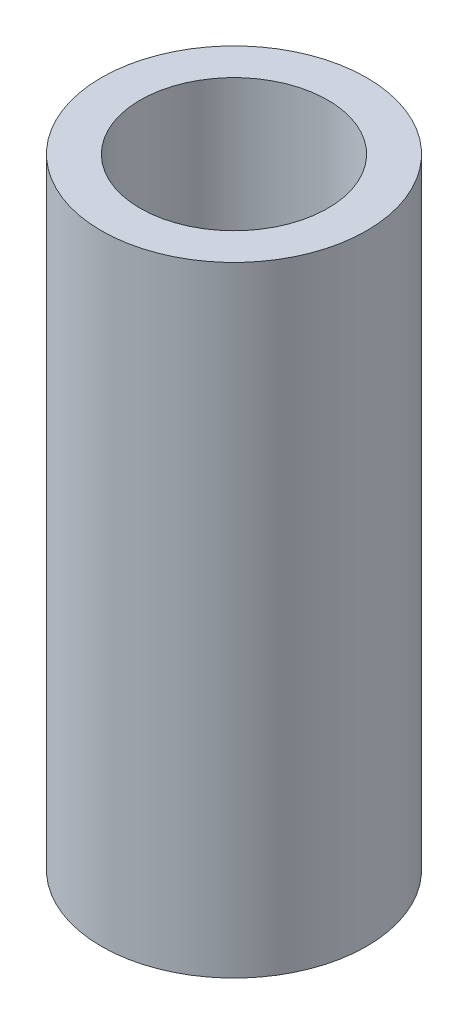
ISO-10303-21;
HEADER;
FILE_DESCRIPTION(('STEP AP214'),'2;1');
FILE_NAME('part.step','',(''),(''),'','','');
FILE_SCHEMA(('AUTOMOTIVE_DESIGN { 1 0 10303 214 1 1 1 1 }'));
ENDSEC;
DATA;
#1=APPLICATION_CONTEXT('core data for automotive mechanical design processes');
#2=APPLICATION_PROTOCOL_DEFINITION('international standard','automotive_design',2000,#1);
#3=PRODUCT_CONTEXT('',#1,'mechanical');
#4=PRODUCT('Part','Part','',(#3));
#5=PRODUCT_RELATED_PRODUCT_CATEGORY('part','',(#4));
#6=PRODUCT_DEFINITION_FORMATION('','',#4);
#7=PRODUCT_DEFINITION_CONTEXT('part definition',#1,'design');
#8=PRODUCT_DEFINITION('design','',#6,#7);
#9=PRODUCT_DEFINITION_SHAPE('','',#8);
#10=(LENGTH_UNIT() NAMED_UNIT(*) SI_UNIT(.MILLI.,.METRE.));
#11=(NAMED_UNIT(*) PLANE_ANGLE_UNIT() SI_UNIT($,.RADIAN.));
#12=(NAMED_UNIT(*) SI_UNIT($,.STERADIAN.) SOLID_ANGLE_UNIT());
#13=UNCERTAINTY_MEASURE_WITH_UNIT(LENGTH_MEASURE(1.E-05),#10,'distance_accuracy_value','');
#14=(GEOMETRIC_REPRESENTATION_CONTEXT(3) GLOBAL_UNCERTAINTY_ASSIGNED_CONTEXT((#13)) GLOBAL_UNIT_ASSIGNED_CONTEXT((#10,
#11,#12)) REPRESENTATION_CONTEXT('',''));
#15=CARTESIAN_POINT('',(0.,0.,0.));
#16=DIRECTION('',(0.,0.,1.));
#17=DIRECTION('',(1.,0.,0.));
#18=AXIS2_PLACEMENT_3D('',#15,#16,#17);
#19=CARTESIAN_POINT('',(0.,46.7295139071892,0.));
#20=DIRECTION('',(0.,-1.,0.));
#21=DIRECTION('',(0.,0.,-1.));
#22=AXIS2_PLACEMENT_3D('',#19,#20,#21);
#23=CYLINDRICAL_SURFACE('',#22,10.);
#24=CARTESIAN_POINT('',(0.,46.7295139071892,0.));
#25=DIRECTION('',(0.,1.,0.));
#26=DIRECTION('',(0.,0.,1.));
#27=AXIS2_PLACEMENT_3D('',#24,#25,#26);
#28=CIRCLE('',#27,10.);
#29=CARTESIAN_POINT('',(0.,46.7295139071892,10.));
#30=VERTEX_POINT('',#29);
#31=EDGE_CURVE('E10',#30,#30,#28,.T.);
#32=ORIENTED_EDGE('',*,*,#31,.F.);
#33=EDGE_LOOP('',(#32));
#34=FACE_BOUND('',#33,.T.);
#35=CARTESIAN_POINT('',(0.,0.,0.));
#36=DIRECTION('',(0.,1.,0.));
#37=DIRECTION('',(0.,0.,1.));
#38=AXIS2_PLACEMENT_3D('',#35,#36,#37);
#39=CIRCLE('',#38,10.);
#40=CARTESIAN_POINT('',(0.,0.,10.));
#41=VERTEX_POINT('',#40);
#42=EDGE_CURVE('E37',#41,#41,#39,.T.);
#43=ORIENTED_EDGE('',*,*,#42,.T.);
#44=EDGE_LOOP('',(#43));
#45=FACE_BOUND('',#44,.T.);
#46=ADVANCED_FACE('F40',(#34,#45),#23,.T.);
#47=CARTESIAN_POINT('',(0.,46.7295139071892,0.));
#48=DIRECTION('',(0.,1.,0.));
#49=DIRECTION('',(0.,0.,1.));
#50=AXIS2_PLACEMENT_3D('',#47,#48,#49);
#51=PLANE('',#50);
#52=CARTESIAN_POINT('',(0.,46.7295139071892,0.));
#53=DIRECTION('',(0.,1.,0.));
#54=DIRECTION('',(0.,0.,1.));
#55=AXIS2_PLACEMENT_3D('',#52,#53,#54);
#56=CIRCLE('',#55,7.07299827268399);
#57=CARTESIAN_POINT('',(0.,46.7295139071892,7.07299827268399));
#58=VERTEX_POINT('',#57);
#59=EDGE_CURVE('E50',#58,#58,#56,.T.);
#60=ORIENTED_EDGE('',*,*,#59,.F.);
#61=EDGE_LOOP('',(#60));
#62=FACE_BOUND('',#61,.T.);
#63=ORIENTED_EDGE('',*,*,#31,.T.);
#64=EDGE_LOOP('',(#63));
#65=FACE_BOUND('',#64,.T.);
#66=ADVANCED_FACE('F59',(#62,#65),#51,.T.);
#67=CARTESIAN_POINT('',(0.,0.,0.));
#68=DIRECTION('',(0.,1.,0.));
#69=DIRECTION('',(0.,0.,1.));
#70=AXIS2_PLACEMENT_3D('',#67,#68,#69);
#71=PLANE('',#70);
#72=CARTESIAN_POINT('',(0.,0.,0.));
#73=DIRECTION('',(0.,1.,0.));
#74=DIRECTION('',(0.,0.,1.));
#75=AXIS2_PLACEMENT_3D('',#72,#73,#74);
#76=CIRCLE('',#75,7.07299827268399);
#77=CARTESIAN_POINT('',(0.,0.,7.07299827268399));
#78=VERTEX_POINT('',#77);
#79=EDGE_CURVE('E47',#78,#78,#76,.T.);
#80=ORIENTED_EDGE('',*,*,#79,.T.);
#81=EDGE_LOOP('',(#80));
#82=FACE_BOUND('',#81,.T.);
#83=ORIENTED_EDGE('',*,*,#42,.F.);
#84=EDGE_LOOP('',(#83));
#85=FACE_BOUND('',#84,.T.);
#86=ADVANCED_FACE('F58',(#82,#85),#71,.F.);
#87=CARTESIAN_POINT('',(0.,46.7295139071892,0.));
#88=DIRECTION('',(0.,-1.,0.));
#89=DIRECTION('',(0.,0.,-1.));
#90=AXIS2_PLACEMENT_3D('',#87,#88,#89);
#91=CYLINDRICAL_SURFACE('',#90,7.07299827268399);
#92=ORIENTED_EDGE('',*,*,#59,.T.);
#93=EDGE_LOOP('',(#92));
#94=FACE_BOUND('',#93,.T.);
#95=ORIENTED_EDGE('',*,*,#79,.F.);
#96=EDGE_LOOP('',(#95));
#97=FACE_BOUND('',#96,.T.);
#98=ADVANCED_FACE('F54',(#94,#97),#91,.F.);
#99=CLOSED_SHELL('',(#46,#66,#86,#98));
#100=MANIFOLD_SOLID_BREP('B2',#99);
#101=ADVANCED_BREP_SHAPE_REPRESENTATION('',(#18,#100),#14);
#102=SHAPE_DEFINITION_REPRESENTATION(#9,#101);
ENDSEC;
END-ISO-10303-21;
